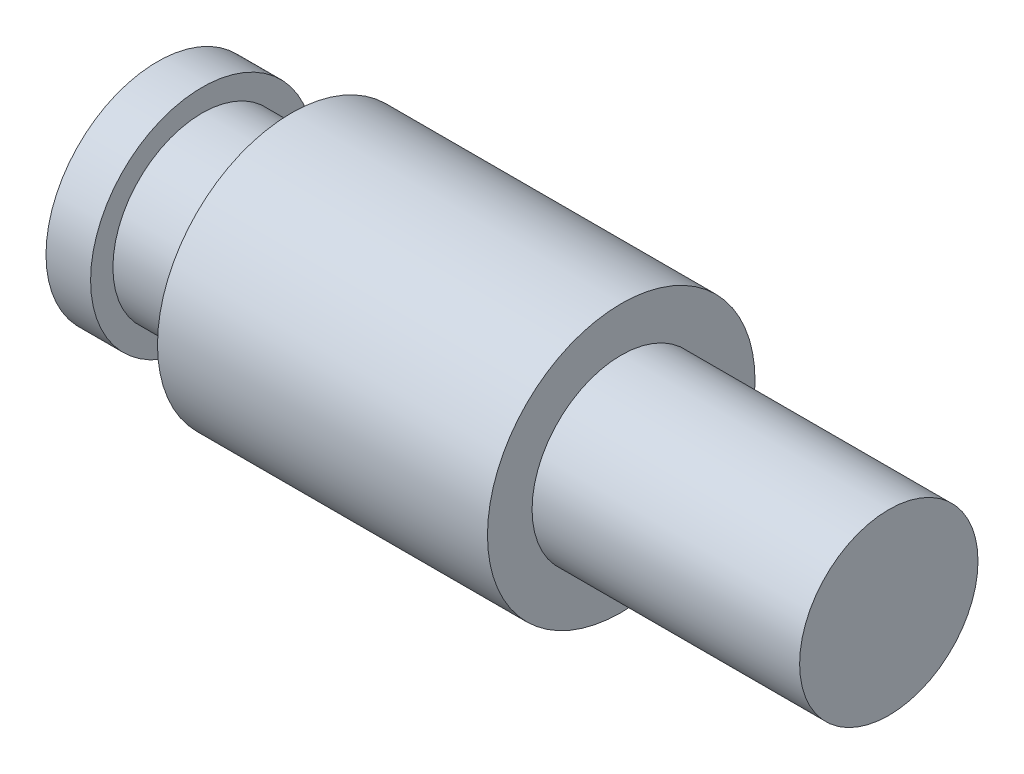
ISO-10303-21;
HEADER;
FILE_DESCRIPTION(('STEP AP214'),'2;1');
FILE_NAME('part.step','',(''),(''),'','','');
FILE_SCHEMA(('AUTOMOTIVE_DESIGN { 1 0 10303 214 1 1 1 1 }'));
ENDSEC;
DATA;
#1=APPLICATION_CONTEXT('core data for automotive mechanical design processes');
#2=APPLICATION_PROTOCOL_DEFINITION('international standard','automotive_design',2000,#1);
#3=PRODUCT_CONTEXT('',#1,'mechanical');
#4=PRODUCT('Part','Part','',(#3));
#5=PRODUCT_RELATED_PRODUCT_CATEGORY('part','',(#4));
#6=PRODUCT_DEFINITION_FORMATION('','',#4);
#7=PRODUCT_DEFINITION_CONTEXT('part definition',#1,'design');
#8=PRODUCT_DEFINITION('design','',#6,#7);
#9=PRODUCT_DEFINITION_SHAPE('','',#8);
#10=(LENGTH_UNIT() NAMED_UNIT(*) SI_UNIT(.MILLI.,.METRE.));
#11=(NAMED_UNIT(*) PLANE_ANGLE_UNIT() SI_UNIT($,.RADIAN.));
#12=(NAMED_UNIT(*) SI_UNIT($,.STERADIAN.) SOLID_ANGLE_UNIT());
#13=UNCERTAINTY_MEASURE_WITH_UNIT(LENGTH_MEASURE(1.E-05),#10,'distance_accuracy_value','');
#14=(GEOMETRIC_REPRESENTATION_CONTEXT(3) GLOBAL_UNCERTAINTY_ASSIGNED_CONTEXT((#13)) GLOBAL_UNIT_ASSIGNED_CONTEXT((#10,
#11,#12)) REPRESENTATION_CONTEXT('',''));
#15=CARTESIAN_POINT('',(0.,0.,0.));
#16=DIRECTION('',(0.,0.,1.));
#17=DIRECTION('',(1.,0.,0.));
#18=AXIS2_PLACEMENT_3D('',#15,#16,#17);
#19=CARTESIAN_POINT('',(0.,0.,0.));
#20=DIRECTION('',(-1.,0.,0.));
#21=DIRECTION('',(0.,0.,1.));
#22=AXIS2_PLACEMENT_3D('',#19,#20,#21);
#23=PLANE('',#22);
#24=CARTESIAN_POINT('',(0.,0.,0.));
#25=DIRECTION('',(1.,0.,0.));
#26=DIRECTION('',(0.,0.,-1.));
#27=AXIS2_PLACEMENT_3D('',#24,#25,#26);
#28=CIRCLE('',#27,2.5);
#29=CARTESIAN_POINT('',(0.,0.,-2.5));
#30=VERTEX_POINT('',#29);
#31=EDGE_CURVE('E10',#30,#30,#28,.T.);
#32=ORIENTED_EDGE('',*,*,#31,.F.);
#33=EDGE_LOOP('',(#32));
#34=FACE_BOUND('',#33,.T.);
#35=ADVANCED_FACE('F32',(#34),#23,.T.);
#36=CARTESIAN_POINT('',(16.4,0.,0.));
#37=DIRECTION('',(1.,0.,0.));
#38=DIRECTION('',(0.,0.,-1.));
#39=AXIS2_PLACEMENT_3D('',#36,#37,#38);
#40=CYLINDRICAL_SURFACE('',#39,2.5);
#41=ORIENTED_EDGE('',*,*,#31,.T.);
#42=EDGE_LOOP('',(#41));
#43=FACE_BOUND('',#42,.T.);
#44=CARTESIAN_POINT('',(1.,0.,0.));
#45=DIRECTION('',(1.,0.,0.));
#46=DIRECTION('',(0.,0.,-1.));
#47=AXIS2_PLACEMENT_3D('',#44,#45,#46);
#48=CIRCLE('',#47,2.5);
#49=CARTESIAN_POINT('',(1.,0.,-2.5));
#50=VERTEX_POINT('',#49);
#51=EDGE_CURVE('E38',#50,#50,#48,.T.);
#52=ORIENTED_EDGE('',*,*,#51,.F.);
#53=EDGE_LOOP('',(#52));
#54=FACE_BOUND('',#53,.T.);
#55=ADVANCED_FACE('F81',(#43,#54),#40,.T.);
#56=CARTESIAN_POINT('',(1.,2.5,0.));
#57=DIRECTION('',(1.,0.,0.));
#58=DIRECTION('',(0.,0.,-1.));
#59=AXIS2_PLACEMENT_3D('',#56,#57,#58);
#60=PLANE('',#59);
#61=ORIENTED_EDGE('',*,*,#51,.T.);
#62=EDGE_LOOP('',(#61));
#63=FACE_BOUND('',#62,.T.);
#64=CARTESIAN_POINT('',(1.,0.,0.));
#65=DIRECTION('',(1.,0.,0.));
#66=DIRECTION('',(0.,0.,-1.));
#67=AXIS2_PLACEMENT_3D('',#64,#65,#66);
#68=CIRCLE('',#67,2.);
#69=CARTESIAN_POINT('',(1.,0.,-2.));
#70=VERTEX_POINT('',#69);
#71=EDGE_CURVE('E42',#70,#70,#68,.T.);
#72=ORIENTED_EDGE('',*,*,#71,.F.);
#73=EDGE_LOOP('',(#72));
#74=FACE_BOUND('',#73,.T.);
#75=ADVANCED_FACE('F86',(#63,#74),#60,.T.);
#76=CARTESIAN_POINT('',(16.4,0.,0.));
#77=DIRECTION('',(1.,0.,0.));
#78=DIRECTION('',(0.,0.,-1.));
#79=AXIS2_PLACEMENT_3D('',#76,#77,#78);
#80=CYLINDRICAL_SURFACE('',#79,2.);
#81=ORIENTED_EDGE('',*,*,#71,.T.);
#82=EDGE_LOOP('',(#81));
#83=FACE_BOUND('',#82,.T.);
#84=CARTESIAN_POINT('',(3.,0.,0.));
#85=DIRECTION('',(1.,0.,0.));
#86=DIRECTION('',(0.,0.,-1.));
#87=AXIS2_PLACEMENT_3D('',#84,#85,#86);
#88=CIRCLE('',#87,2.);
#89=CARTESIAN_POINT('',(3.,0.,-2.));
#90=VERTEX_POINT('',#89);
#91=EDGE_CURVE('E46',#90,#90,#88,.T.);
#92=ORIENTED_EDGE('',*,*,#91,.F.);
#93=EDGE_LOOP('',(#92));
#94=FACE_BOUND('',#93,.T.);
#95=ADVANCED_FACE('F90',(#83,#94),#80,.T.);
#96=CARTESIAN_POINT('',(3.,2.,0.));
#97=DIRECTION('',(-1.,0.,0.));
#98=DIRECTION('',(0.,0.,1.));
#99=AXIS2_PLACEMENT_3D('',#96,#97,#98);
#100=PLANE('',#99);
#101=ORIENTED_EDGE('',*,*,#91,.T.);
#102=EDGE_LOOP('',(#101));
#103=FACE_BOUND('',#102,.T.);
#104=CARTESIAN_POINT('',(3.,0.,0.));
#105=DIRECTION('',(1.,0.,0.));
#106=DIRECTION('',(0.,0.,-1.));
#107=AXIS2_PLACEMENT_3D('',#104,#105,#106);
#108=CIRCLE('',#107,3.);
#109=CARTESIAN_POINT('',(3.,0.,-3.));
#110=VERTEX_POINT('',#109);
#111=EDGE_CURVE('E51',#110,#110,#108,.T.);
#112=ORIENTED_EDGE('',*,*,#111,.F.);
#113=EDGE_LOOP('',(#112));
#114=FACE_BOUND('',#113,.T.);
#115=ADVANCED_FACE('F96',(#103,#114),#100,.T.);
#116=CARTESIAN_POINT('',(16.4,0.,0.));
#117=DIRECTION('',(1.,0.,0.));
#118=DIRECTION('',(0.,0.,-1.));
#119=AXIS2_PLACEMENT_3D('',#116,#117,#118);
#120=CYLINDRICAL_SURFACE('',#119,3.);
#121=ORIENTED_EDGE('',*,*,#111,.T.);
#122=EDGE_LOOP('',(#121));
#123=FACE_BOUND('',#122,.T.);
#124=CARTESIAN_POINT('',(10.4,0.,0.));
#125=DIRECTION('',(1.,0.,0.));
#126=DIRECTION('',(0.,0.,-1.));
#127=AXIS2_PLACEMENT_3D('',#124,#125,#126);
#128=CIRCLE('',#127,3.);
#129=CARTESIAN_POINT('',(10.4,0.,-3.));
#130=VERTEX_POINT('',#129);
#131=EDGE_CURVE('E54',#130,#130,#128,.T.);
#132=ORIENTED_EDGE('',*,*,#131,.F.);
#133=EDGE_LOOP('',(#132));
#134=FACE_BOUND('',#133,.T.);
#135=ADVANCED_FACE('F77',(#123,#134),#120,.T.);
#136=CARTESIAN_POINT('',(10.4,3.,0.));
#137=DIRECTION('',(1.,0.,0.));
#138=DIRECTION('',(0.,0.,-1.));
#139=AXIS2_PLACEMENT_3D('',#136,#137,#138);
#140=PLANE('',#139);
#141=ORIENTED_EDGE('',*,*,#131,.T.);
#142=EDGE_LOOP('',(#141));
#143=FACE_BOUND('',#142,.T.);
#144=CARTESIAN_POINT('',(10.4,0.,0.));
#145=DIRECTION('',(1.,0.,0.));
#146=DIRECTION('',(0.,0.,-1.));
#147=AXIS2_PLACEMENT_3D('',#144,#145,#146);
#148=CIRCLE('',#147,2.);
#149=CARTESIAN_POINT('',(10.4,0.,-2.));
#150=VERTEX_POINT('',#149);
#151=EDGE_CURVE('E58',#150,#150,#148,.T.);
#152=ORIENTED_EDGE('',*,*,#151,.F.);
#153=EDGE_LOOP('',(#152));
#154=FACE_BOUND('',#153,.T.);
#155=ADVANCED_FACE('F69',(#143,#154),#140,.T.);
#156=CARTESIAN_POINT('',(16.4,0.,0.));
#157=DIRECTION('',(1.,0.,0.));
#158=DIRECTION('',(0.,0.,-1.));
#159=AXIS2_PLACEMENT_3D('',#156,#157,#158);
#160=CYLINDRICAL_SURFACE('',#159,2.);
#161=ORIENTED_EDGE('',*,*,#151,.T.);
#162=EDGE_LOOP('',(#161));
#163=FACE_BOUND('',#162,.T.);
#164=CARTESIAN_POINT('',(16.4,0.,0.));
#165=DIRECTION('',(1.,0.,0.));
#166=DIRECTION('',(0.,0.,-1.));
#167=AXIS2_PLACEMENT_3D('',#164,#165,#166);
#168=CIRCLE('',#167,2.);
#169=CARTESIAN_POINT('',(16.4,0.,-2.));
#170=VERTEX_POINT('',#169);
#171=EDGE_CURVE('E61',#170,#170,#168,.T.);
#172=ORIENTED_EDGE('',*,*,#171,.F.);
#173=EDGE_LOOP('',(#172));
#174=FACE_BOUND('',#173,.T.);
#175=ADVANCED_FACE('F67',(#163,#174),#160,.T.);
#176=CARTESIAN_POINT('',(16.4,2.,0.));
#177=DIRECTION('',(1.,0.,0.));
#178=DIRECTION('',(0.,0.,-1.));
#179=AXIS2_PLACEMENT_3D('',#176,#177,#178);
#180=PLANE('',#179);
#181=ORIENTED_EDGE('',*,*,#171,.T.);
#182=EDGE_LOOP('',(#181));
#183=FACE_BOUND('',#182,.T.);
#184=ADVANCED_FACE('F65',(#183),#180,.T.);
#185=CLOSED_SHELL('',(#35,#55,#75,#95,#115,#135,#155,#175,#184));
#186=MANIFOLD_SOLID_BREP('B2',#185);
#187=ADVANCED_BREP_SHAPE_REPRESENTATION('',(#18,#186),#14);
#188=SHAPE_DEFINITION_REPRESENTATION(#9,#187);
ENDSEC;
END-ISO-10303-21;
